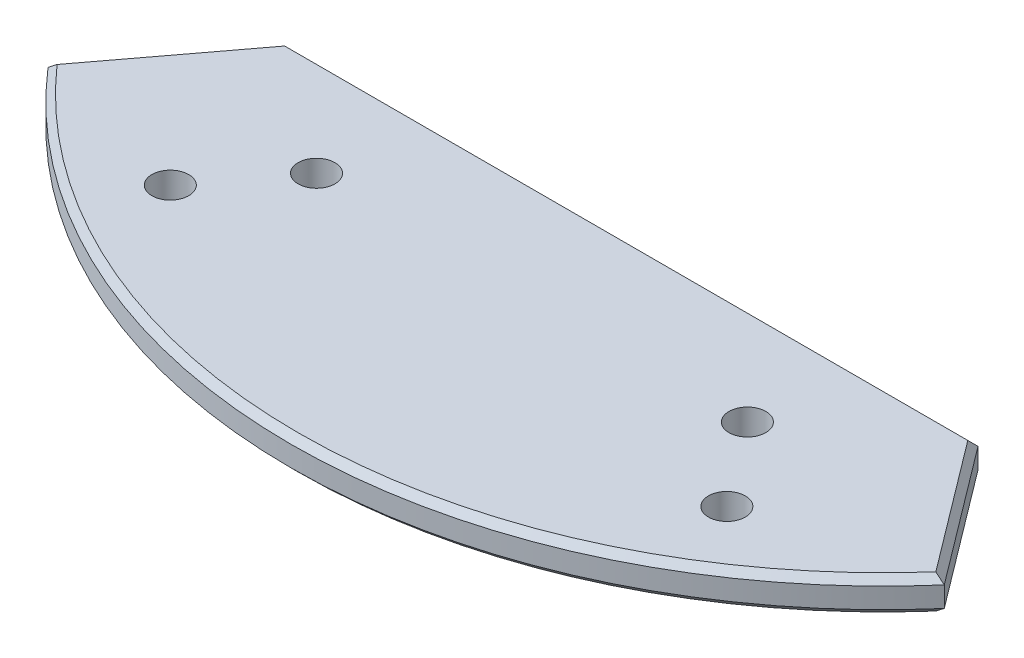
ISO-10303-21;
HEADER;
FILE_DESCRIPTION(('STEP AP214'),'2;1');
FILE_NAME('part.step','',(''),(''),'','','');
FILE_SCHEMA(('AUTOMOTIVE_DESIGN { 1 0 10303 214 1 1 1 1 }'));
ENDSEC;
DATA;
#1=APPLICATION_CONTEXT('core data for automotive mechanical design processes');
#2=APPLICATION_PROTOCOL_DEFINITION('international standard','automotive_design',2000,#1);
#3=PRODUCT_CONTEXT('',#1,'mechanical');
#4=PRODUCT('Part','Part','',(#3));
#5=PRODUCT_RELATED_PRODUCT_CATEGORY('part','',(#4));
#6=PRODUCT_DEFINITION_FORMATION('','',#4);
#7=PRODUCT_DEFINITION_CONTEXT('part definition',#1,'design');
#8=PRODUCT_DEFINITION('design','',#6,#7);
#9=PRODUCT_DEFINITION_SHAPE('','',#8);
#10=(LENGTH_UNIT() NAMED_UNIT(*) SI_UNIT(.MILLI.,.METRE.));
#11=(NAMED_UNIT(*) PLANE_ANGLE_UNIT() SI_UNIT($,.RADIAN.));
#12=(NAMED_UNIT(*) SI_UNIT($,.STERADIAN.) SOLID_ANGLE_UNIT());
#13=UNCERTAINTY_MEASURE_WITH_UNIT(LENGTH_MEASURE(1.E-05),#10,'distance_accuracy_value','');
#14=(GEOMETRIC_REPRESENTATION_CONTEXT(3) GLOBAL_UNCERTAINTY_ASSIGNED_CONTEXT((#13)) GLOBAL_UNIT_ASSIGNED_CONTEXT((#10,
#11,#12)) REPRESENTATION_CONTEXT('',''));
#15=CARTESIAN_POINT('',(0.,0.,0.));
#16=DIRECTION('',(0.,0.,1.));
#17=DIRECTION('',(1.,0.,0.));
#18=AXIS2_PLACEMENT_3D('',#15,#16,#17);
#19=CARTESIAN_POINT('',(0.,42.,0.));
#20=DIRECTION('',(0.,1.,0.));
#21=DIRECTION('',(0.,0.,1.));
#22=AXIS2_PLACEMENT_3D('',#19,#20,#21);
#23=PLANE('',#22);
#24=CARTESIAN_POINT('',(0.,42.,0.));
#25=DIRECTION('',(0.,1.,0.));
#26=DIRECTION('',(0.,0.,1.));
#27=AXIS2_PLACEMENT_3D('',#24,#25,#26);
#28=CIRCLE('',#27,103.4);
#29=CARTESIAN_POINT('',(-77.567251727104,42.,68.3731047964336));
#30=VERTEX_POINT('',#29);
#31=CARTESIAN_POINT('',(77.567251727104,42.,68.3731047964336));
#32=VERTEX_POINT('',#31);
#33=EDGE_CURVE('E336',#30,#32,#28,.T.);
#34=ORIENTED_EDGE('',*,*,#33,.T.);
#35=DIRECTION('',(-0.601815023152044,0.,-0.798635510047296));
#36=VECTOR('',#35,1.);
#37=CARTESIAN_POINT('',(59.9396654937416,42.,44.9805077677824));
#38=LINE('',#37,#36);
#39=CARTESIAN_POINT('',(60.2997301761343,42.,45.45832974));
#40=VERTEX_POINT('',#39);
#41=EDGE_CURVE('E348',#32,#40,#38,.T.);
#42=ORIENTED_EDGE('',*,*,#41,.T.);
#43=DIRECTION('',(-1.,0.,0.));
#44=VECTOR('',#43,1.);
#45=CARTESIAN_POINT('',(-60.8980281057984,42.,45.45832974));
#46=LINE('',#45,#44);
#47=CARTESIAN_POINT('',(-60.2997301761343,42.,45.45832974));
#48=VERTEX_POINT('',#47);
#49=EDGE_CURVE('E252',#40,#48,#46,.T.);
#50=ORIENTED_EDGE('',*,*,#49,.T.);
#51=DIRECTION('',(-0.601815023152044,0.,0.798635510047296));
#52=VECTOR('',#51,1.);
#53=CARTESIAN_POINT('',(-78.1533770671421,42.,69.1509193937515));
#54=LINE('',#53,#52);
#55=EDGE_CURVE('E339',#48,#30,#54,.T.);
#56=ORIENTED_EDGE('',*,*,#55,.T.);
#57=EDGE_LOOP('',(#34,#42,#50,#56));
#58=FACE_BOUND('',#57,.T.);
#59=CARTESIAN_POINT('',(-49.1257524027389,42.,76.8235563221193));
#60=DIRECTION('',(0.,1.,0.));
#61=DIRECTION('',(0.,0.,-1.));
#62=AXIS2_PLACEMENT_3D('',#59,#60,#61);
#63=CIRCLE('',#62,3.25);
#64=CARTESIAN_POINT('',(-49.1257524027389,42.,73.5735563221193));
#65=VERTEX_POINT('',#64);
#66=EDGE_CURVE('E177',#65,#65,#63,.T.);
#67=ORIENTED_EDGE('',*,*,#66,.F.);
#68=EDGE_LOOP('',(#67));
#69=FACE_BOUND('',#68,.T.);
#70=CARTESIAN_POINT('',(49.1257524027389,42.,76.8235563221193));
#71=DIRECTION('',(0.,1.,0.));
#72=DIRECTION('',(0.,0.,1.));
#73=AXIS2_PLACEMENT_3D('',#70,#71,#72);
#74=CIRCLE('',#73,3.25);
#75=CARTESIAN_POINT('',(49.1257524027389,42.,80.0735563221193));
#76=VERTEX_POINT('',#75);
#77=EDGE_CURVE('E193',#76,#76,#74,.T.);
#78=ORIENTED_EDGE('',*,*,#77,.F.);
#79=EDGE_LOOP('',(#78));
#80=FACE_BOUND('',#79,.T.);
#81=CARTESIAN_POINT('',(38.0319103852598,42.,62.1015307209486));
#82=DIRECTION('',(0.,1.,0.));
#83=DIRECTION('',(0.,0.,1.));
#84=AXIS2_PLACEMENT_3D('',#81,#82,#83);
#85=CIRCLE('',#84,3.25);
#86=CARTESIAN_POINT('',(38.0319103852598,42.,65.3515307209486));
#87=VERTEX_POINT('',#86);
#88=EDGE_CURVE('E185',#87,#87,#85,.T.);
#89=ORIENTED_EDGE('',*,*,#88,.F.);
#90=EDGE_LOOP('',(#89));
#91=FACE_BOUND('',#90,.T.);
#92=CARTESIAN_POINT('',(-38.0319103852598,42.,62.1015307209486));
#93=DIRECTION('',(0.,1.,0.));
#94=DIRECTION('',(0.,0.,-1.));
#95=AXIS2_PLACEMENT_3D('',#92,#93,#94);
#96=CIRCLE('',#95,3.25);
#97=CARTESIAN_POINT('',(-38.0319103852598,42.,58.8515307209486));
#98=VERTEX_POINT('',#97);
#99=EDGE_CURVE('E167',#98,#98,#96,.T.);
#100=ORIENTED_EDGE('',*,*,#99,.F.);
#101=EDGE_LOOP('',(#100));
#102=FACE_BOUND('',#101,.T.);
#103=ADVANCED_FACE('F40',(#58,#69,#80,#91,#102),#23,.T.);
#104=CARTESIAN_POINT('',(0.,36.,0.));
#105=DIRECTION('',(0.,1.,0.));
#106=DIRECTION('',(0.,0.,1.));
#107=AXIS2_PLACEMENT_3D('',#104,#105,#106);
#108=PLANE('',#107);
#109=CARTESIAN_POINT('',(0.,36.,44.25832974));
#110=DIRECTION('',(0.,-1.,0.));
#111=DIRECTION('',(0.,0.,-1.));
#112=AXIS2_PLACEMENT_3D('',#109,#110,#111);
#113=CIRCLE('',#112,4.);
#114=CARTESIAN_POINT('',(3.81575680566777,36.,45.45832974));
#115=VERTEX_POINT('',#114);
#116=CARTESIAN_POINT('',(-3.81575680566777,36.,45.45832974));
#117=VERTEX_POINT('',#116);
#118=EDGE_CURVE('E155',#115,#117,#113,.T.);
#119=ORIENTED_EDGE('',*,*,#118,.F.);
#120=DIRECTION('',(1.,0.,0.));
#121=VECTOR('',#120,1.);
#122=CARTESIAN_POINT('',(0.,36.,45.45832974));
#123=LINE('',#122,#121);
#124=CARTESIAN_POINT('',(60.2997301761342,36.,45.45832974));
#125=VERTEX_POINT('',#124);
#126=EDGE_CURVE('E237',#115,#125,#123,.T.);
#127=ORIENTED_EDGE('',*,*,#126,.T.);
#128=DIRECTION('',(0.601815023152044,0.,0.798635510047296));
#129=VECTOR('',#128,1.);
#130=CARTESIAN_POINT('',(16.6116186089837,36.,-12.5177524815625));
#131=LINE('',#130,#129);
#132=CARTESIAN_POINT('',(77.567251727104,36.,68.3731047964335));
#133=VERTEX_POINT('',#132);
#134=EDGE_CURVE('E234',#125,#133,#131,.T.);
#135=ORIENTED_EDGE('',*,*,#134,.T.);
#136=CARTESIAN_POINT('',(0.,36.,0.));
#137=DIRECTION('',(0.,1.,0.));
#138=DIRECTION('',(0.,0.,1.));
#139=AXIS2_PLACEMENT_3D('',#136,#137,#138);
#140=CIRCLE('',#139,103.4);
#141=CARTESIAN_POINT('',(-77.567251727104,36.,68.3731047964336));
#142=VERTEX_POINT('',#141);
#143=EDGE_CURVE('E225',#133,#142,#140,.F.);
#144=ORIENTED_EDGE('',*,*,#143,.T.);
#145=DIRECTION('',(0.601815023152044,0.,-0.798635510047296));
#146=VECTOR('',#145,1.);
#147=CARTESIAN_POINT('',(-16.6116186089837,36.,-12.5177524815625));
#148=LINE('',#147,#146);
#149=CARTESIAN_POINT('',(-60.2997301761342,36.,45.45832974));
#150=VERTEX_POINT('',#149);
#151=EDGE_CURVE('E228',#142,#150,#148,.T.);
#152=ORIENTED_EDGE('',*,*,#151,.T.);
#153=DIRECTION('',(1.,0.,0.));
#154=VECTOR('',#153,1.);
#155=CARTESIAN_POINT('',(0.,36.,45.45832974));
#156=LINE('',#155,#154);
#157=EDGE_CURVE('E231',#150,#117,#156,.T.);
#158=ORIENTED_EDGE('',*,*,#157,.T.);
#159=EDGE_LOOP('',(#119,#127,#135,#144,#152,#158));
#160=FACE_BOUND('',#159,.T.);
#161=CARTESIAN_POINT('',(0.,36.,91.29880712));
#162=DIRECTION('',(0.,-1.,0.));
#163=DIRECTION('',(0.,0.,-1.));
#164=AXIS2_PLACEMENT_3D('',#161,#162,#163);
#165=CIRCLE('',#164,4.);
#166=CARTESIAN_POINT('',(0.,36.,87.29880712));
#167=VERTEX_POINT('',#166);
#168=EDGE_CURVE('E623',#167,#167,#165,.T.);
#169=ORIENTED_EDGE('',*,*,#168,.F.);
#170=EDGE_LOOP('',(#169));
#171=FACE_BOUND('',#170,.T.);
#172=CARTESIAN_POINT('',(0.,36.,67.77856843));
#173=DIRECTION('',(0.,-1.,0.));
#174=DIRECTION('',(0.,0.,-1.));
#175=AXIS2_PLACEMENT_3D('',#172,#173,#174);
#176=CIRCLE('',#175,4.);
#177=CARTESIAN_POINT('',(0.,36.,63.77856843));
#178=VERTEX_POINT('',#177);
#179=EDGE_CURVE('E154',#178,#178,#176,.T.);
#180=ORIENTED_EDGE('',*,*,#179,.F.);
#181=EDGE_LOOP('',(#180));
#182=FACE_BOUND('',#181,.T.);
#183=CARTESIAN_POINT('',(49.1257524027389,36.,76.8235563221193));
#184=DIRECTION('',(0.,1.,0.));
#185=DIRECTION('',(0.,0.,1.));
#186=AXIS2_PLACEMENT_3D('',#183,#184,#185);
#187=CIRCLE('',#186,3.25);
#188=CARTESIAN_POINT('',(49.1257524027389,36.,80.0735563221193));
#189=VERTEX_POINT('',#188);
#190=EDGE_CURVE('E189',#189,#189,#187,.T.);
#191=ORIENTED_EDGE('',*,*,#190,.T.);
#192=EDGE_LOOP('',(#191));
#193=FACE_BOUND('',#192,.T.);
#194=CARTESIAN_POINT('',(38.0319103852598,36.,62.1015307209486));
#195=DIRECTION('',(0.,1.,0.));
#196=DIRECTION('',(0.,0.,1.));
#197=AXIS2_PLACEMENT_3D('',#194,#195,#196);
#198=CIRCLE('',#197,3.25);
#199=CARTESIAN_POINT('',(38.0319103852598,36.,65.3515307209486));
#200=VERTEX_POINT('',#199);
#201=EDGE_CURVE('E181',#200,#200,#198,.T.);
#202=ORIENTED_EDGE('',*,*,#201,.T.);
#203=EDGE_LOOP('',(#202));
#204=FACE_BOUND('',#203,.T.);
#205=CARTESIAN_POINT('',(-49.1257524027389,36.,76.8235563221193));
#206=DIRECTION('',(0.,1.,0.));
#207=DIRECTION('',(0.,0.,-1.));
#208=AXIS2_PLACEMENT_3D('',#205,#206,#207);
#209=CIRCLE('',#208,3.25);
#210=CARTESIAN_POINT('',(-49.1257524027389,36.,73.5735563221193));
#211=VERTEX_POINT('',#210);
#212=EDGE_CURVE('E171',#211,#211,#209,.T.);
#213=ORIENTED_EDGE('',*,*,#212,.T.);
#214=EDGE_LOOP('',(#213));
#215=FACE_BOUND('',#214,.T.);
#216=CARTESIAN_POINT('',(-38.0319103852598,36.,62.1015307209486));
#217=DIRECTION('',(0.,1.,0.));
#218=DIRECTION('',(0.,0.,-1.));
#219=AXIS2_PLACEMENT_3D('',#216,#217,#218);
#220=CIRCLE('',#219,3.25);
#221=CARTESIAN_POINT('',(-38.0319103852598,36.,58.8515307209486));
#222=VERTEX_POINT('',#221);
#223=EDGE_CURVE('E172',#222,#222,#220,.T.);
#224=ORIENTED_EDGE('',*,*,#223,.T.);
#225=EDGE_LOOP('',(#224));
#226=FACE_BOUND('',#225,.T.);
#227=ADVANCED_FACE('F372',(#160,#171,#182,#193,#204,#215,#226),#108,.F.);
#228=CARTESIAN_POINT('',(-60.8980281057984,42.,44.25832974));
#229=DIRECTION('',(0.798635510047296,0.,0.601815023152043));
#230=DIRECTION('',(0.601815023152044,0.,-0.798635510047296));
#231=AXIS2_PLACEMENT_3D('',#228,#229,#230);
#232=PLANE('',#231);
#233=DIRECTION('',(0.,-1.,0.));
#234=VECTOR('',#233,1.);
#235=CARTESIAN_POINT('',(-79.1117396791988,42.,68.4287413659691));
#236=LINE('',#235,#234);
#237=CARTESIAN_POINT('',(-79.1117396791988,40.8,68.4287413659691));
#238=VERTEX_POINT('',#237);
#239=CARTESIAN_POINT('',(-79.1117396791988,37.2,68.4287413659691));
#240=VERTEX_POINT('',#239);
#241=EDGE_CURVE('E150',#238,#240,#236,.T.);
#242=ORIENTED_EDGE('',*,*,#241,.F.);
#243=DIRECTION('',(0.601815023152044,0.,-0.798635510047296));
#244=VECTOR('',#243,1.);
#245=CARTESIAN_POINT('',(-60.8980281057984,40.8,44.25832974));
#246=LINE('',#245,#244);
#247=CARTESIAN_POINT('',(-60.8980281057984,40.8,44.25832974));
#248=VERTEX_POINT('',#247);
#249=EDGE_CURVE('E57',#238,#248,#246,.T.);
#250=ORIENTED_EDGE('',*,*,#249,.T.);
#251=DIRECTION('',(0.,-1.,0.));
#252=VECTOR('',#251,1.);
#253=CARTESIAN_POINT('',(-60.8980281057984,42.,44.25832974));
#254=LINE('',#253,#252);
#255=CARTESIAN_POINT('',(-60.8980281057984,37.2,44.25832974));
#256=VERTEX_POINT('',#255);
#257=EDGE_CURVE('E197',#248,#256,#254,.T.);
#258=ORIENTED_EDGE('',*,*,#257,.T.);
#259=DIRECTION('',(-0.601815023152044,0.,0.798635510047296));
#260=VECTOR('',#259,1.);
#261=CARTESIAN_POINT('',(-60.8980281057984,37.2,44.25832974));
#262=LINE('',#261,#260);
#263=EDGE_CURVE('E244',#256,#240,#262,.T.);
#264=ORIENTED_EDGE('',*,*,#263,.T.);
#265=EDGE_LOOP('',(#242,#250,#258,#264));
#266=FACE_BOUND('',#265,.T.);
#267=ADVANCED_FACE('F377',(#266),#232,.F.);
#268=CARTESIAN_POINT('',(0.,42.,0.));
#269=DIRECTION('',(0.,-1.,0.));
#270=DIRECTION('',(0.,0.,-1.));
#271=AXIS2_PLACEMENT_3D('',#268,#269,#270);
#272=CYLINDRICAL_SURFACE('',#271,104.6);
#273=DIRECTION('',(0.,-1.,0.));
#274=VECTOR('',#273,1.);
#275=CARTESIAN_POINT('',(79.1117396791988,42.,68.4287413659691));
#276=LINE('',#275,#274);
#277=CARTESIAN_POINT('',(79.1117396791988,40.8,68.4287413659691));
#278=VERTEX_POINT('',#277);
#279=CARTESIAN_POINT('',(79.1117396791988,37.2,68.4287413659691));
#280=VERTEX_POINT('',#279);
#281=EDGE_CURVE('E206',#278,#280,#276,.T.);
#282=ORIENTED_EDGE('',*,*,#281,.F.);
#283=CARTESIAN_POINT('',(0.,40.8,0.));
#284=DIRECTION('',(0.,1.,0.));
#285=DIRECTION('',(0.,0.,1.));
#286=AXIS2_PLACEMENT_3D('',#283,#284,#285);
#287=CIRCLE('',#286,104.6);
#288=EDGE_CURVE('E72',#278,#238,#287,.F.);
#289=ORIENTED_EDGE('',*,*,#288,.T.);
#290=ORIENTED_EDGE('',*,*,#241,.T.);
#291=CARTESIAN_POINT('',(0.,37.2,0.));
#292=DIRECTION('',(0.,1.,0.));
#293=DIRECTION('',(0.,0.,1.));
#294=AXIS2_PLACEMENT_3D('',#291,#292,#293);
#295=CIRCLE('',#294,104.6);
#296=EDGE_CURVE('E248',#240,#280,#295,.T.);
#297=ORIENTED_EDGE('',*,*,#296,.T.);
#298=EDGE_LOOP('',(#282,#289,#290,#297));
#299=FACE_BOUND('',#298,.T.);
#300=ADVANCED_FACE('F378',(#299),#272,.T.);
#301=CARTESIAN_POINT('',(60.8980281057984,42.,44.25832974));
#302=DIRECTION('',(-0.798635510047296,0.,0.601815023152044));
#303=DIRECTION('',(0.601815023152044,0.,0.798635510047296));
#304=AXIS2_PLACEMENT_3D('',#301,#302,#303);
#305=PLANE('',#304);
#306=DIRECTION('',(0.,-1.,0.));
#307=VECTOR('',#306,1.);
#308=CARTESIAN_POINT('',(60.8980281057984,42.,44.25832974));
#309=LINE('',#308,#307);
#310=CARTESIAN_POINT('',(60.8980281057984,40.8,44.25832974));
#311=VERTEX_POINT('',#310);
#312=CARTESIAN_POINT('',(60.8980281057984,37.2,44.25832974));
#313=VERTEX_POINT('',#312);
#314=EDGE_CURVE('E203',#311,#313,#309,.T.);
#315=ORIENTED_EDGE('',*,*,#314,.F.);
#316=DIRECTION('',(0.601815023152044,0.,0.798635510047296));
#317=VECTOR('',#316,1.);
#318=CARTESIAN_POINT('',(79.1117396791988,40.8,68.4287413659691));
#319=LINE('',#318,#317);
#320=EDGE_CURVE('E343',#311,#278,#319,.T.);
#321=ORIENTED_EDGE('',*,*,#320,.T.);
#322=ORIENTED_EDGE('',*,*,#281,.T.);
#323=DIRECTION('',(-0.601815023152044,0.,-0.798635510047296));
#324=VECTOR('',#323,1.);
#325=CARTESIAN_POINT('',(60.8980281057984,37.2,44.25832974));
#326=LINE('',#325,#324);
#327=EDGE_CURVE('E240',#280,#313,#326,.T.);
#328=ORIENTED_EDGE('',*,*,#327,.T.);
#329=EDGE_LOOP('',(#315,#321,#322,#328));
#330=FACE_BOUND('',#329,.T.);
#331=ADVANCED_FACE('F383',(#330),#305,.F.);
#332=CARTESIAN_POINT('',(-60.8980281057984,42.,44.25832974));
#333=DIRECTION('',(0.,0.,1.));
#334=DIRECTION('',(1.,0.,0.));
#335=AXIS2_PLACEMENT_3D('',#332,#333,#334);
#336=PLANE('',#335);
#337=ORIENTED_EDGE('',*,*,#257,.F.);
#338=DIRECTION('',(1.,0.,0.));
#339=VECTOR('',#338,1.);
#340=CARTESIAN_POINT('',(60.8980281057984,40.8,44.25832974));
#341=LINE('',#340,#339);
#342=EDGE_CURVE('E11',#248,#311,#341,.T.);
#343=ORIENTED_EDGE('',*,*,#342,.T.);
#344=ORIENTED_EDGE('',*,*,#314,.T.);
#345=DIRECTION('',(-1.,0.,0.));
#346=VECTOR('',#345,1.);
#347=CARTESIAN_POINT('',(-60.8980281057984,37.2,44.25832974));
#348=LINE('',#347,#346);
#349=CARTESIAN_POINT('',(4.,37.2,44.25832974));
#350=VERTEX_POINT('',#349);
#351=EDGE_CURVE('E139',#313,#350,#348,.T.);
#352=ORIENTED_EDGE('',*,*,#351,.T.);
#353=DIRECTION('',(0.,-1.,0.));
#354=VECTOR('',#353,1.);
#355=CARTESIAN_POINT('',(4.,40.,44.25832974));
#356=LINE('',#355,#354);
#357=CARTESIAN_POINT('',(4.,40.,44.25832974));
#358=VERTEX_POINT('',#357);
#359=EDGE_CURVE('E133',#350,#358,#356,.F.);
#360=ORIENTED_EDGE('',*,*,#359,.T.);
#361=DIRECTION('',(1.,0.,0.));
#362=VECTOR('',#361,1.);
#363=CARTESIAN_POINT('',(-60.8980281057984,40.,44.25832974));
#364=LINE('',#363,#362);
#365=CARTESIAN_POINT('',(-4.,40.,44.25832974));
#366=VERTEX_POINT('',#365);
#367=EDGE_CURVE('E137',#366,#358,#364,.T.);
#368=ORIENTED_EDGE('',*,*,#367,.F.);
#369=DIRECTION('',(0.,-1.,0.));
#370=VECTOR('',#369,1.);
#371=CARTESIAN_POINT('',(-4.,40.,44.25832974));
#372=LINE('',#371,#370);
#373=CARTESIAN_POINT('',(-4.,37.2,44.25832974));
#374=VERTEX_POINT('',#373);
#375=EDGE_CURVE('E143',#366,#374,#372,.T.);
#376=ORIENTED_EDGE('',*,*,#375,.T.);
#377=DIRECTION('',(-1.,0.,0.));
#378=VECTOR('',#377,1.);
#379=CARTESIAN_POINT('',(-60.8980281057984,37.2,44.25832974));
#380=LINE('',#379,#378);
#381=EDGE_CURVE('E213',#374,#256,#380,.T.);
#382=ORIENTED_EDGE('',*,*,#381,.T.);
#383=EDGE_LOOP('',(#337,#343,#344,#352,#360,#368,#376,#382));
#384=FACE_BOUND('',#383,.T.);
#385=ADVANCED_FACE('F135',(#384),#336,.F.);
#386=CARTESIAN_POINT('',(49.1257524027389,42.,76.8235563221193));
#387=DIRECTION('',(0.,-1.,0.));
#388=DIRECTION('',(0.,0.,-1.));
#389=AXIS2_PLACEMENT_3D('',#386,#387,#388);
#390=CYLINDRICAL_SURFACE('',#389,3.25);
#391=ORIENTED_EDGE('',*,*,#77,.T.);
#392=EDGE_LOOP('',(#391));
#393=FACE_BOUND('',#392,.T.);
#394=ORIENTED_EDGE('',*,*,#190,.F.);
#395=EDGE_LOOP('',(#394));
#396=FACE_BOUND('',#395,.T.);
#397=ADVANCED_FACE('F420',(#393,#396),#390,.F.);
#398=CARTESIAN_POINT('',(38.0319103852598,42.,62.1015307209486));
#399=DIRECTION('',(0.,-1.,0.));
#400=DIRECTION('',(0.,0.,-1.));
#401=AXIS2_PLACEMENT_3D('',#398,#399,#400);
#402=CYLINDRICAL_SURFACE('',#401,3.25);
#403=ORIENTED_EDGE('',*,*,#88,.T.);
#404=EDGE_LOOP('',(#403));
#405=FACE_BOUND('',#404,.T.);
#406=ORIENTED_EDGE('',*,*,#201,.F.);
#407=EDGE_LOOP('',(#406));
#408=FACE_BOUND('',#407,.T.);
#409=ADVANCED_FACE('F542',(#405,#408),#402,.F.);
#410=CARTESIAN_POINT('',(-49.1257524027389,42.,76.8235563221193));
#411=DIRECTION('',(0.,-1.,0.));
#412=DIRECTION('',(0.,0.,-1.));
#413=AXIS2_PLACEMENT_3D('',#410,#411,#412);
#414=CYLINDRICAL_SURFACE('',#413,3.25);
#415=ORIENTED_EDGE('',*,*,#66,.T.);
#416=EDGE_LOOP('',(#415));
#417=FACE_BOUND('',#416,.T.);
#418=ORIENTED_EDGE('',*,*,#212,.F.);
#419=EDGE_LOOP('',(#418));
#420=FACE_BOUND('',#419,.T.);
#421=ADVANCED_FACE('F404',(#417,#420),#414,.F.);
#422=CARTESIAN_POINT('',(-38.0319103852598,42.,62.1015307209486));
#423=DIRECTION('',(0.,-1.,0.));
#424=DIRECTION('',(0.,0.,-1.));
#425=AXIS2_PLACEMENT_3D('',#422,#423,#424);
#426=CYLINDRICAL_SURFACE('',#425,3.25);
#427=ORIENTED_EDGE('',*,*,#99,.T.);
#428=EDGE_LOOP('',(#427));
#429=FACE_BOUND('',#428,.T.);
#430=ORIENTED_EDGE('',*,*,#223,.F.);
#431=EDGE_LOOP('',(#430));
#432=FACE_BOUND('',#431,.T.);
#433=ADVANCED_FACE('F401',(#429,#432),#426,.F.);
#434=CARTESIAN_POINT('',(0.,40.,44.25832974));
#435=DIRECTION('',(0.,-1.,0.));
#436=DIRECTION('',(0.,0.,-1.));
#437=AXIS2_PLACEMENT_3D('',#434,#435,#436);
#438=CYLINDRICAL_SURFACE('',#437,4.);
#439=ORIENTED_EDGE('',*,*,#359,.F.);
#440=CARTESIAN_POINT('',(0.,37.2,44.25832974));
#441=DIRECTION('',(0.,0.707106781186547,0.707106781186547));
#442=DIRECTION('',(0.,-0.707106781186548,0.707106781186548));
#443=AXIS2_PLACEMENT_3D('',#440,#441,#442);
#444=ELLIPSE('',#443,5.65685424949238,4.);
#445=EDGE_CURVE('E222',#350,#115,#444,.F.);
#446=ORIENTED_EDGE('',*,*,#445,.T.);
#447=ORIENTED_EDGE('',*,*,#118,.T.);
#448=CARTESIAN_POINT('',(0.,37.2,44.25832974));
#449=DIRECTION('',(0.,0.707106781186547,0.707106781186547));
#450=DIRECTION('',(0.,-0.707106781186548,0.707106781186548));
#451=AXIS2_PLACEMENT_3D('',#448,#449,#450);
#452=ELLIPSE('',#451,5.65685424949238,4.);
#453=EDGE_CURVE('E219',#117,#374,#452,.F.);
#454=ORIENTED_EDGE('',*,*,#453,.T.);
#455=ORIENTED_EDGE('',*,*,#375,.F.);
#456=CARTESIAN_POINT('',(0.,40.,44.25832974));
#457=DIRECTION('',(0.,-1.,0.));
#458=DIRECTION('',(0.,0.,-1.));
#459=AXIS2_PLACEMENT_3D('',#456,#457,#458);
#460=CIRCLE('',#459,4.);
#461=EDGE_CURVE('E147',#358,#366,#460,.T.);
#462=ORIENTED_EDGE('',*,*,#461,.F.);
#463=EDGE_LOOP('',(#439,#446,#447,#454,#455,#462));
#464=FACE_BOUND('',#463,.T.);
#465=ADVANCED_FACE('F152',(#464),#438,.F.);
#466=CARTESIAN_POINT('',(0.,40.,44.25832974));
#467=DIRECTION('',(0.,-1.,0.));
#468=DIRECTION('',(0.,0.,-1.));
#469=AXIS2_PLACEMENT_3D('',#466,#467,#468);
#470=PLANE('',#469);
#471=ORIENTED_EDGE('',*,*,#367,.T.);
#472=ORIENTED_EDGE('',*,*,#461,.T.);
#473=EDGE_LOOP('',(#471,#472));
#474=FACE_BOUND('',#473,.T.);
#475=ADVANCED_FACE('F146',(#474),#470,.T.);
#476=CARTESIAN_POINT('',(0.,40.,67.77856843));
#477=DIRECTION('',(0.,-1.,0.));
#478=DIRECTION('',(0.,0.,-1.));
#479=AXIS2_PLACEMENT_3D('',#476,#477,#478);
#480=CYLINDRICAL_SURFACE('',#479,4.);
#481=CARTESIAN_POINT('',(0.,40.,67.77856843));
#482=DIRECTION('',(0.,-1.,0.));
#483=DIRECTION('',(0.,0.,-1.));
#484=AXIS2_PLACEMENT_3D('',#481,#482,#483);
#485=CIRCLE('',#484,4.);
#486=CARTESIAN_POINT('',(0.,40.,63.77856843));
#487=VERTEX_POINT('',#486);
#488=EDGE_CURVE('E160',#487,#487,#485,.T.);
#489=ORIENTED_EDGE('',*,*,#488,.F.);
#490=EDGE_LOOP('',(#489));
#491=FACE_BOUND('',#490,.T.);
#492=ORIENTED_EDGE('',*,*,#179,.T.);
#493=EDGE_LOOP('',(#492));
#494=FACE_BOUND('',#493,.T.);
#495=ADVANCED_FACE('F507',(#491,#494),#480,.F.);
#496=CARTESIAN_POINT('',(0.,40.,67.77856843));
#497=DIRECTION('',(0.,-1.,0.));
#498=DIRECTION('',(0.,0.,-1.));
#499=AXIS2_PLACEMENT_3D('',#496,#497,#498);
#500=PLANE('',#499);
#501=ORIENTED_EDGE('',*,*,#488,.T.);
#502=EDGE_LOOP('',(#501));
#503=FACE_BOUND('',#502,.T.);
#504=ADVANCED_FACE('F498',(#503),#500,.T.);
#505=CARTESIAN_POINT('',(0.,40.,91.29880712));
#506=DIRECTION('',(0.,-1.,0.));
#507=DIRECTION('',(0.,0.,-1.));
#508=AXIS2_PLACEMENT_3D('',#505,#506,#507);
#509=CYLINDRICAL_SURFACE('',#508,4.);
#510=CARTESIAN_POINT('',(0.,40.,91.29880712));
#511=DIRECTION('',(0.,-1.,0.));
#512=DIRECTION('',(0.,0.,-1.));
#513=AXIS2_PLACEMENT_3D('',#510,#511,#512);
#514=CIRCLE('',#513,4.);
#515=CARTESIAN_POINT('',(0.,40.,87.29880712));
#516=VERTEX_POINT('',#515);
#517=EDGE_CURVE('E176',#516,#516,#514,.T.);
#518=ORIENTED_EDGE('',*,*,#517,.F.);
#519=EDGE_LOOP('',(#518));
#520=FACE_BOUND('',#519,.T.);
#521=ORIENTED_EDGE('',*,*,#168,.T.);
#522=EDGE_LOOP('',(#521));
#523=FACE_BOUND('',#522,.T.);
#524=ADVANCED_FACE('F489',(#520,#523),#509,.F.);
#525=CARTESIAN_POINT('',(0.,40.,91.29880712));
#526=DIRECTION('',(0.,-1.,0.));
#527=DIRECTION('',(0.,0.,-1.));
#528=AXIS2_PLACEMENT_3D('',#525,#526,#527);
#529=PLANE('',#528);
#530=ORIENTED_EDGE('',*,*,#517,.T.);
#531=EDGE_LOOP('',(#530));
#532=FACE_BOUND('',#531,.T.);
#533=ADVANCED_FACE('F299',(#532),#529,.T.);
#534=CARTESIAN_POINT('',(-60.8980281057984,37.2,44.25832974));
#535=DIRECTION('',(0.,0.707106781186547,0.707106781186547));
#536=DIRECTION('',(-1.,0.,0.));
#537=AXIS2_PLACEMENT_3D('',#534,#535,#536);
#538=PLANE('',#537);
#539=ORIENTED_EDGE('',*,*,#453,.F.);
#540=ORIENTED_EDGE('',*,*,#157,.F.);
#541=DIRECTION('',(0.332492407540105,-0.666876599877438,0.666876599877438));
#542=VECTOR('',#541,1.);
#543=CARTESIAN_POINT('',(-60.8980281057984,37.2,44.25832974));
#544=LINE('',#543,#542);
#545=EDGE_CURVE('E163',#256,#150,#544,.T.);
#546=ORIENTED_EDGE('',*,*,#545,.F.);
#547=ORIENTED_EDGE('',*,*,#381,.F.);
#548=EDGE_LOOP('',(#539,#540,#546,#547));
#549=FACE_BOUND('',#548,.T.);
#550=ADVANCED_FACE('F294',(#549),#538,.F.);
#551=CARTESIAN_POINT('',(-60.8980281057984,37.2,44.25832974));
#552=DIRECTION('',(0.564720584850819,0.70710678118655,0.425547483890748));
#553=DIRECTION('',(-0.601815023152044,0.,0.798635510047296));
#554=AXIS2_PLACEMENT_3D('',#551,#552,#553);
#555=PLANE('',#554);
#556=ORIENTED_EDGE('',*,*,#545,.T.);
#557=ORIENTED_EDGE('',*,*,#151,.F.);
#558=CARTESIAN_POINT('',(-79.1117396791988,37.2,68.4287413659691));
#559=CARTESIAN_POINT('',(-78.8544872831871,36.9997629104399,68.420077891747));
#560=CARTESIAN_POINT('',(-78.5971537566326,36.7996443662745,68.4111097738717));
#561=CARTESIAN_POINT('',(-78.0823244392697,36.3996443662716,68.3925642507007));
#562=CARTESIAN_POINT('',(-77.8248286484592,36.199762910437,68.3829868453975));
#563=CARTESIAN_POINT('',(-77.567251727104,36.,68.3731047964336));
#564=B_SPLINE_CURVE_WITH_KNOTS('',3,(#558,#559,#560,#561,#562,#563),.UNSPECIFIED.,.F.,.F.,(4,2,
4),(0.,0.978333084749065,1.95666618153978),.UNSPECIFIED.);
#565=EDGE_CURVE('E267',#240,#142,#564,.T.);
#566=ORIENTED_EDGE('',*,*,#565,.F.);
#567=ORIENTED_EDGE('',*,*,#263,.F.);
#568=EDGE_LOOP('',(#556,#557,#566,#567));
#569=FACE_BOUND('',#568,.T.);
#570=ADVANCED_FACE('F287',(#569),#555,.F.);
#571=CARTESIAN_POINT('',(0.,37.2,0.));
#572=DIRECTION('',(0.,1.,0.));
#573=DIRECTION('',(0.,0.,1.));
#574=AXIS2_PLACEMENT_3D('',#571,#572,#573);
#575=CONICAL_SURFACE('',#574,104.6,0.785398163397448);
#576=ORIENTED_EDGE('',*,*,#565,.T.);
#577=ORIENTED_EDGE('',*,*,#143,.F.);
#578=CARTESIAN_POINT('',(77.567251727104,36.,68.3731047964335));
#579=CARTESIAN_POINT('',(77.8248286484592,36.199762910437,68.3829868453975));
#580=CARTESIAN_POINT('',(78.0823244392697,36.3996443662716,68.3925642507007));
#581=CARTESIAN_POINT('',(78.5971537566327,36.7996443662745,68.4111097738717));
#582=CARTESIAN_POINT('',(78.8544872831871,36.9997629104399,68.420077891747));
#583=CARTESIAN_POINT('',(79.1117396791988,37.2,68.4287413659691));
#584=B_SPLINE_CURVE_WITH_KNOTS('',3,(#578,#579,#580,#581,#582,#583),.UNSPECIFIED.,.F.,.F.,(4,2,
4),(0.,0.978333096790727,1.9566661815398),.UNSPECIFIED.);
#585=EDGE_CURVE('E257',#280,#133,#584,.F.);
#586=ORIENTED_EDGE('',*,*,#585,.F.);
#587=ORIENTED_EDGE('',*,*,#296,.F.);
#588=EDGE_LOOP('',(#576,#577,#586,#587));
#589=FACE_BOUND('',#588,.T.);
#590=ADVANCED_FACE('F275',(#589),#575,.T.);
#591=CARTESIAN_POINT('',(60.8980281057984,37.2,44.25832974));
#592=DIRECTION('',(-0.56472058485082,0.707106781186547,0.425547483890749));
#593=DIRECTION('',(-0.601815023152044,0.,-0.798635510047296));
#594=AXIS2_PLACEMENT_3D('',#591,#592,#593);
#595=PLANE('',#594);
#596=ORIENTED_EDGE('',*,*,#585,.T.);
#597=ORIENTED_EDGE('',*,*,#134,.F.);
#598=DIRECTION('',(0.332492407540101,0.666876599877439,-0.666876599877439));
#599=VECTOR('',#598,1.);
#600=CARTESIAN_POINT('',(60.8980281057984,37.2,44.25832974));
#601=LINE('',#600,#599);
#602=EDGE_CURVE('E253',#313,#125,#601,.F.);
#603=ORIENTED_EDGE('',*,*,#602,.F.);
#604=ORIENTED_EDGE('',*,*,#327,.F.);
#605=EDGE_LOOP('',(#596,#597,#603,#604));
#606=FACE_BOUND('',#605,.T.);
#607=ADVANCED_FACE('F279',(#606),#595,.F.);
#608=CARTESIAN_POINT('',(-60.8980281057984,37.2,44.25832974));
#609=DIRECTION('',(0.,0.707106781186547,0.707106781186547));
#610=DIRECTION('',(-1.,0.,0.));
#611=AXIS2_PLACEMENT_3D('',#608,#609,#610);
#612=PLANE('',#611);
#613=ORIENTED_EDGE('',*,*,#602,.T.);
#614=ORIENTED_EDGE('',*,*,#126,.F.);
#615=ORIENTED_EDGE('',*,*,#445,.F.);
#616=ORIENTED_EDGE('',*,*,#351,.F.);
#617=EDGE_LOOP('',(#613,#614,#615,#616));
#618=FACE_BOUND('',#617,.T.);
#619=ADVANCED_FACE('F285',(#618),#612,.F.);
#620=CARTESIAN_POINT('',(-16.6116186089838,42.,-12.5177524815625));
#621=DIRECTION('',(-0.564720584850824,0.707106781186543,-0.425547483890752));
#622=DIRECTION('',(0.601815023152044,0.,-0.798635510047296));
#623=AXIS2_PLACEMENT_3D('',#620,#621,#622);
#624=PLANE('',#623);
#625=DIRECTION('',(0.332492407540099,0.666876599877443,0.666876599877436));
#626=VECTOR('',#625,1.);
#627=CARTESIAN_POINT('',(-53.6335225808565,55.3703439669668,58.8286737069667));
#628=LINE('',#627,#626);
#629=EDGE_CURVE('E322',#248,#48,#628,.T.);
#630=ORIENTED_EDGE('',*,*,#629,.F.);
#631=ORIENTED_EDGE('',*,*,#249,.F.);
#632=CARTESIAN_POINT('',(-79.1117396791988,40.8,68.4287413659691));
#633=CARTESIAN_POINT('',(-78.8544872831871,41.0002370895601,68.420077891747));
#634=CARTESIAN_POINT('',(-78.5971537566326,41.2003556337255,68.4111097738717));
#635=CARTESIAN_POINT('',(-78.0823244392697,41.6003556337284,68.3925642507007));
#636=CARTESIAN_POINT('',(-77.8248286484593,41.800237089563,68.3829868453975));
#637=CARTESIAN_POINT('',(-77.567251727104,42.,68.3731047964335));
#638=B_SPLINE_CURVE_WITH_KNOTS('',3,(#632,#633,#634,#635,#636,#637),.UNSPECIFIED.,.F.,.F.,(4,2,
4),(0.,0.97833308474905,1.95666618153974),.UNSPECIFIED.);
#639=EDGE_CURVE('E46',#30,#238,#638,.F.);
#640=ORIENTED_EDGE('',*,*,#639,.F.);
#641=ORIENTED_EDGE('',*,*,#55,.F.);
#642=EDGE_LOOP('',(#630,#631,#640,#641));
#643=FACE_BOUND('',#642,.T.);
#644=ADVANCED_FACE('F43',(#643),#624,.T.);
#645=CARTESIAN_POINT('',(0.,42.,0.));
#646=DIRECTION('',(0.,-1.,0.));
#647=DIRECTION('',(0.,0.,-1.));
#648=AXIS2_PLACEMENT_3D('',#645,#646,#647);
#649=CONICAL_SURFACE('',#648,103.4,0.785398163397443);
#650=ORIENTED_EDGE('',*,*,#639,.T.);
#651=ORIENTED_EDGE('',*,*,#288,.F.);
#652=CARTESIAN_POINT('',(79.1117396791988,40.8,68.4287413659691));
#653=CARTESIAN_POINT('',(78.8544872831871,41.0002370895601,68.420077891747));
#654=CARTESIAN_POINT('',(78.5971537566327,41.2003556337255,68.4111097738717));
#655=CARTESIAN_POINT('',(78.0823244392697,41.6003556337284,68.3925642507007));
#656=CARTESIAN_POINT('',(77.8248286484593,41.800237089563,68.3829868453974));
#657=CARTESIAN_POINT('',(77.567251727104,42.,68.3731047964335));
#658=B_SPLINE_CURVE_WITH_KNOTS('',3,(#652,#653,#654,#655,#656,#657),.UNSPECIFIED.,.F.,.F.,(4,2,
4),(0.,0.97833308474905,1.95666618153975),.UNSPECIFIED.);
#659=EDGE_CURVE('E315',#32,#278,#658,.F.);
#660=ORIENTED_EDGE('',*,*,#659,.F.);
#661=ORIENTED_EDGE('',*,*,#33,.F.);
#662=EDGE_LOOP('',(#650,#651,#660,#661));
#663=FACE_BOUND('',#662,.T.);
#664=ADVANCED_FACE('F302',(#663),#649,.T.);
#665=CARTESIAN_POINT('',(0.,42.,45.45832974));
#666=DIRECTION('',(0.,0.707106781186544,-0.707106781186552));
#667=DIRECTION('',(1.,0.,0.));
#668=AXIS2_PLACEMENT_3D('',#665,#666,#667);
#669=PLANE('',#668);
#670=ORIENTED_EDGE('',*,*,#629,.T.);
#671=ORIENTED_EDGE('',*,*,#49,.F.);
#672=DIRECTION('',(0.332492407540099,-0.666876599877443,-0.666876599877436));
#673=VECTOR('',#672,1.);
#674=CARTESIAN_POINT('',(53.6335225808565,55.3703439669668,58.8286737069667));
#675=LINE('',#674,#673);
#676=EDGE_CURVE('E323',#311,#40,#675,.F.);
#677=ORIENTED_EDGE('',*,*,#676,.F.);
#678=ORIENTED_EDGE('',*,*,#342,.F.);
#679=EDGE_LOOP('',(#670,#671,#677,#678));
#680=FACE_BOUND('',#679,.T.);
#681=ADVANCED_FACE('F309',(#680),#669,.T.);
#682=CARTESIAN_POINT('',(16.6116186089838,42.,-12.5177524815625));
#683=DIRECTION('',(0.564720584850824,0.707106781186543,-0.425547483890752));
#684=DIRECTION('',(0.601815023152044,0.,0.798635510047296));
#685=AXIS2_PLACEMENT_3D('',#682,#683,#684);
#686=PLANE('',#685);
#687=ORIENTED_EDGE('',*,*,#659,.T.);
#688=ORIENTED_EDGE('',*,*,#320,.F.);
#689=ORIENTED_EDGE('',*,*,#676,.T.);
#690=ORIENTED_EDGE('',*,*,#41,.F.);
#691=EDGE_LOOP('',(#687,#688,#689,#690));
#692=FACE_BOUND('',#691,.T.);
#693=ADVANCED_FACE('F311',(#692),#686,.T.);
#694=CLOSED_SHELL('',(#103,#227,#267,#300,#331,#385,#397,#409,#421,#433,#465,#475,#495,#504,
#524,#533,#550,#570,#590,#607,#619,#644,#664,#681,#693));
#695=MANIFOLD_SOLID_BREP('B2',#694);
#696=ADVANCED_BREP_SHAPE_REPRESENTATION('',(#18,#695),#14);
#697=SHAPE_DEFINITION_REPRESENTATION(#9,#696);
ENDSEC;
END-ISO-10303-21;
